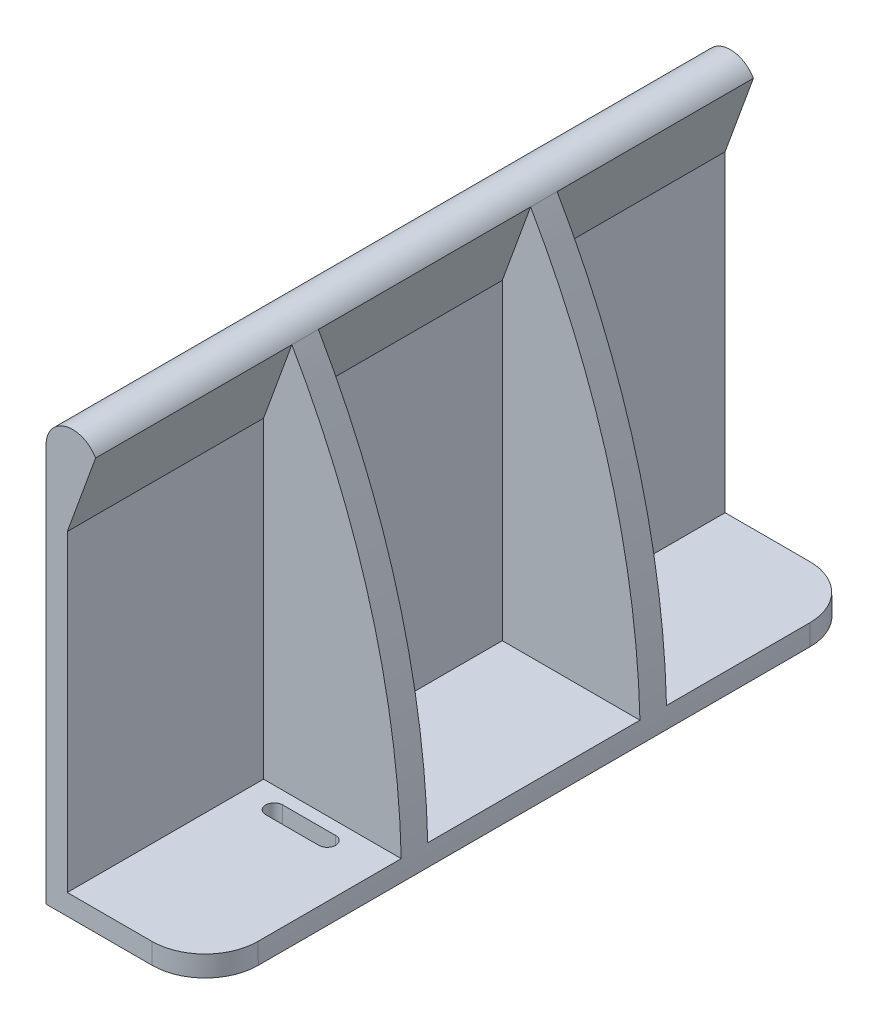
ISO-10303-21;
HEADER;
FILE_DESCRIPTION(('STEP AP214'),'2;1');
FILE_NAME('part.step','',(''),(''),'','','');
FILE_SCHEMA(('AUTOMOTIVE_DESIGN { 1 0 10303 214 1 1 1 1 }'));
ENDSEC;
DATA;
#1=APPLICATION_CONTEXT('core data for automotive mechanical design processes');
#2=APPLICATION_PROTOCOL_DEFINITION('international standard','automotive_design',2000,#1);
#3=PRODUCT_CONTEXT('',#1,'mechanical');
#4=PRODUCT('Part','Part','',(#3));
#5=PRODUCT_RELATED_PRODUCT_CATEGORY('part','',(#4));
#6=PRODUCT_DEFINITION_FORMATION('','',#4);
#7=PRODUCT_DEFINITION_CONTEXT('part definition',#1,'design');
#8=PRODUCT_DEFINITION('design','',#6,#7);
#9=PRODUCT_DEFINITION_SHAPE('','',#8);
#10=(LENGTH_UNIT() NAMED_UNIT(*) SI_UNIT(.MILLI.,.METRE.));
#11=(NAMED_UNIT(*) PLANE_ANGLE_UNIT() SI_UNIT($,.RADIAN.));
#12=(NAMED_UNIT(*) SI_UNIT($,.STERADIAN.) SOLID_ANGLE_UNIT());
#13=UNCERTAINTY_MEASURE_WITH_UNIT(LENGTH_MEASURE(1.E-05),#10,'distance_accuracy_value','');
#14=(GEOMETRIC_REPRESENTATION_CONTEXT(3) GLOBAL_UNCERTAINTY_ASSIGNED_CONTEXT((#13)) GLOBAL_UNIT_ASSIGNED_CONTEXT((#10,
#11,#12)) REPRESENTATION_CONTEXT('',''));
#15=CARTESIAN_POINT('',(0.,0.,0.));
#16=DIRECTION('',(0.,0.,1.));
#17=DIRECTION('',(1.,0.,0.));
#18=AXIS2_PLACEMENT_3D('',#15,#16,#17);
#19=CARTESIAN_POINT('',(-125.625,0.,62.));
#20=DIRECTION('',(0.,0.,-1.));
#21=DIRECTION('',(-1.,0.,0.));
#22=AXIS2_PLACEMENT_3D('',#19,#20,#21);
#23=CYLINDRICAL_SURFACE('',#22,155.625);
#24=DIRECTION('',(0.,0.,-1.));
#25=VECTOR('',#24,1.);
#26=CARTESIAN_POINT('',(30.,0.,62.));
#27=LINE('',#26,#25);
#28=CARTESIAN_POINT('',(30.,0.,52.));
#29=VERTEX_POINT('',#28);
#30=CARTESIAN_POINT('',(30.,0.,-52.));
#31=VERTEX_POINT('',#30);
#32=EDGE_CURVE('E373',#29,#31,#27,.T.);
#33=ORIENTED_EDGE('',*,*,#32,.T.);
#34=CARTESIAN_POINT('',(-125.625,0.,-52.));
#35=DIRECTION('',(0.,0.,-1.));
#36=DIRECTION('',(-1.,0.,0.));
#37=AXIS2_PLACEMENT_3D('',#34,#35,#36);
#38=CIRCLE('',#37,155.625);
#39=CARTESIAN_POINT('',(29.9510902997068,3.90137822537895,-52.));
#40=VERTEX_POINT('',#39);
#41=EDGE_CURVE('E394',#31,#40,#38,.F.);
#42=ORIENTED_EDGE('',*,*,#41,.T.);
#43=DIRECTION('',(0.,0.,-1.));
#44=VECTOR('',#43,1.);
#45=CARTESIAN_POINT('',(29.9510902997068,3.90137822537895,62.));
#46=LINE('',#45,#44);
#47=CARTESIAN_POINT('',(29.9510902997068,3.90137822537895,-25.));
#48=VERTEX_POINT('',#47);
#49=EDGE_CURVE('E294',#40,#48,#46,.F.);
#50=ORIENTED_EDGE('',*,*,#49,.T.);
#51=CARTESIAN_POINT('',(-125.625,0.,-25.));
#52=DIRECTION('',(0.,0.,-1.));
#53=DIRECTION('',(-1.,0.,0.));
#54=AXIS2_PLACEMENT_3D('',#51,#52,#53);
#55=CIRCLE('',#54,155.625);
#56=CARTESIAN_POINT('',(9.33609958506221,77.4896265560166,-25.));
#57=VERTEX_POINT('',#56);
#58=EDGE_CURVE('E296',#57,#48,#55,.T.);
#59=ORIENTED_EDGE('',*,*,#58,.F.);
#60=DIRECTION('',(0.,0.,-1.));
#61=VECTOR('',#60,1.);
#62=CARTESIAN_POINT('',(9.33609958506221,77.4896265560166,62.));
#63=LINE('',#62,#61);
#64=CARTESIAN_POINT('',(9.33609958506221,77.4896265560166,-20.));
#65=VERTEX_POINT('',#64);
#66=EDGE_CURVE('E369',#65,#57,#63,.T.);
#67=ORIENTED_EDGE('',*,*,#66,.F.);
#68=CARTESIAN_POINT('',(-125.625,0.,-20.));
#69=DIRECTION('',(0.,0.,1.));
#70=DIRECTION('',(1.,0.,0.));
#71=AXIS2_PLACEMENT_3D('',#68,#69,#70);
#72=CIRCLE('',#71,155.625);
#73=CARTESIAN_POINT('',(29.9485858846224,4.,-20.));
#74=VERTEX_POINT('',#73);
#75=EDGE_CURVE('E347',#74,#65,#72,.T.);
#76=ORIENTED_EDGE('',*,*,#75,.F.);
#77=DIRECTION('',(0.,0.,1.));
#78=VECTOR('',#77,1.);
#79=CARTESIAN_POINT('',(29.9485858846224,4.,-20.));
#80=LINE('',#79,#78);
#81=CARTESIAN_POINT('',(29.9485858846224,4.,20.));
#82=VERTEX_POINT('',#81);
#83=EDGE_CURVE('E335',#74,#82,#80,.T.);
#84=ORIENTED_EDGE('',*,*,#83,.T.);
#85=CARTESIAN_POINT('',(-125.625,0.,20.));
#86=DIRECTION('',(0.,0.,1.));
#87=DIRECTION('',(1.,0.,0.));
#88=AXIS2_PLACEMENT_3D('',#85,#86,#87);
#89=CIRCLE('',#88,155.625);
#90=CARTESIAN_POINT('',(9.33609958506221,77.4896265560166,20.));
#91=VERTEX_POINT('',#90);
#92=EDGE_CURVE('E338',#82,#91,#89,.T.);
#93=ORIENTED_EDGE('',*,*,#92,.T.);
#94=CARTESIAN_POINT('',(9.33609958506221,77.4896265560166,25.));
#95=VERTEX_POINT('',#94);
#96=EDGE_CURVE('E374',#95,#91,#63,.T.);
#97=ORIENTED_EDGE('',*,*,#96,.F.);
#98=CARTESIAN_POINT('',(-125.625,0.,25.));
#99=DIRECTION('',(0.,0.,1.));
#100=DIRECTION('',(1.,0.,0.));
#101=AXIS2_PLACEMENT_3D('',#98,#99,#100);
#102=CIRCLE('',#101,155.625);
#103=CARTESIAN_POINT('',(29.9510902997068,3.90137822537895,25.));
#104=VERTEX_POINT('',#103);
#105=EDGE_CURVE('E314',#104,#95,#102,.T.);
#106=ORIENTED_EDGE('',*,*,#105,.F.);
#107=DIRECTION('',(0.,0.,-1.));
#108=VECTOR('',#107,1.);
#109=CARTESIAN_POINT('',(29.9510902997068,3.90137822537895,62.));
#110=LINE('',#109,#108);
#111=CARTESIAN_POINT('',(29.9510902997068,3.90137822537895,52.));
#112=VERTEX_POINT('',#111);
#113=EDGE_CURVE('E312',#112,#104,#110,.T.);
#114=ORIENTED_EDGE('',*,*,#113,.F.);
#115=CARTESIAN_POINT('',(-125.625,0.,52.));
#116=DIRECTION('',(0.,0.,-1.));
#117=DIRECTION('',(-1.,0.,0.));
#118=AXIS2_PLACEMENT_3D('',#115,#116,#117);
#119=CIRCLE('',#118,155.625);
#120=EDGE_CURVE('E392',#112,#29,#119,.T.);
#121=ORIENTED_EDGE('',*,*,#120,.T.);
#122=EDGE_LOOP('',(#33,#42,#50,#59,#67,#76,#84,#93,#97,#106,#114,#121));
#123=FACE_BOUND('',#122,.T.);
#124=ADVANCED_FACE('F33',(#123),#23,.T.);
#125=CARTESIAN_POINT('',(5.,75.,62.));
#126=DIRECTION('',(0.,0.,-1.));
#127=DIRECTION('',(-1.,0.,0.));
#128=AXIS2_PLACEMENT_3D('',#125,#126,#127);
#129=PLANE('',#128);
#130=DIRECTION('',(1.,0.,0.));
#131=VECTOR('',#130,1.);
#132=CARTESIAN_POINT('',(30.,0.,62.));
#133=LINE('',#132,#131);
#134=CARTESIAN_POINT('',(0.,0.,62.));
#135=VERTEX_POINT('',#134);
#136=CARTESIAN_POINT('',(20.,0.,62.));
#137=VERTEX_POINT('',#136);
#138=EDGE_CURVE('E351',#135,#137,#133,.T.);
#139=ORIENTED_EDGE('',*,*,#138,.T.);
#140=CARTESIAN_POINT('',(-125.625,0.,62.));
#141=DIRECTION('',(0.,0.,-1.));
#142=DIRECTION('',(-1.,0.,0.));
#143=AXIS2_PLACEMENT_3D('',#140,#141,#142);
#144=CIRCLE('',#143,145.625);
#145=CARTESIAN_POINT('',(19.9477305265053,3.90137822537895,62.));
#146=VERTEX_POINT('',#145);
#147=EDGE_CURVE('E47',#137,#146,#144,.F.);
#148=ORIENTED_EDGE('',*,*,#147,.T.);
#149=DIRECTION('',(1.,0.,0.));
#150=VECTOR('',#149,1.);
#151=CARTESIAN_POINT('',(5.,3.90137822537895,62.));
#152=LINE('',#151,#150);
#153=CARTESIAN_POINT('',(4.,3.90137822537895,62.));
#154=VERTEX_POINT('',#153);
#155=EDGE_CURVE('E377',#154,#146,#152,.T.);
#156=ORIENTED_EDGE('',*,*,#155,.F.);
#157=DIRECTION('',(0.,-1.,0.));
#158=VECTOR('',#157,1.);
#159=CARTESIAN_POINT('',(4.,75.,62.));
#160=LINE('',#159,#158);
#161=CARTESIAN_POINT('',(4.,62.828813438097,62.));
#162=VERTEX_POINT('',#161);
#163=EDGE_CURVE('E380',#162,#154,#160,.T.);
#164=ORIENTED_EDGE('',*,*,#163,.F.);
#165=DIRECTION('',(-0.34202014332567,-0.939692620785908,0.));
#166=VECTOR('',#165,1.);
#167=CARTESIAN_POINT('',(8.02872173702779,73.8976354398468,62.));
#168=LINE('',#167,#166);
#169=CARTESIAN_POINT('',(9.33609958506221,77.4896265560166,62.));
#170=VERTEX_POINT('',#169);
#171=EDGE_CURVE('E383',#170,#162,#168,.T.);
#172=ORIENTED_EDGE('',*,*,#171,.F.);
#173=CARTESIAN_POINT('',(5.,75.,62.));
#174=DIRECTION('',(0.,0.,1.));
#175=DIRECTION('',(-1.,0.,0.));
#176=AXIS2_PLACEMENT_3D('',#173,#174,#175);
#177=CIRCLE('',#176,4.99999999999996);
#178=CARTESIAN_POINT('',(0.,75.,62.));
#179=VERTEX_POINT('',#178);
#180=EDGE_CURVE('E353',#170,#179,#177,.T.);
#181=ORIENTED_EDGE('',*,*,#180,.T.);
#182=DIRECTION('',(0.,-1.,0.));
#183=VECTOR('',#182,1.);
#184=CARTESIAN_POINT('',(0.,0.,62.));
#185=LINE('',#184,#183);
#186=EDGE_CURVE('E356',#179,#135,#185,.T.);
#187=ORIENTED_EDGE('',*,*,#186,.T.);
#188=EDGE_LOOP('',(#139,#148,#156,#164,#172,#181,#187));
#189=FACE_BOUND('',#188,.T.);
#190=ADVANCED_FACE('F453',(#189),#129,.F.);
#191=CARTESIAN_POINT('',(30.,0.,62.));
#192=DIRECTION('',(0.,1.,0.));
#193=DIRECTION('',(-1.,0.,0.));
#194=AXIS2_PLACEMENT_3D('',#191,#192,#193);
#195=PLANE('',#194);
#196=CARTESIAN_POINT('',(20.,0.,29.));
#197=DIRECTION('',(0.,-1.,0.));
#198=DIRECTION('',(1.,0.,0.));
#199=AXIS2_PLACEMENT_3D('',#196,#197,#198);
#200=CIRCLE('',#199,1.6);
#201=CARTESIAN_POINT('',(20.,0.,27.4));
#202=VERTEX_POINT('',#201);
#203=CARTESIAN_POINT('',(20.,0.,30.6));
#204=VERTEX_POINT('',#203);
#205=EDGE_CURVE('E232',#202,#204,#200,.T.);
#206=ORIENTED_EDGE('',*,*,#205,.F.);
#207=DIRECTION('',(1.,0.,0.));
#208=VECTOR('',#207,1.);
#209=CARTESIAN_POINT('',(10.,0.,27.4));
#210=LINE('',#209,#208);
#211=CARTESIAN_POINT('',(10.,0.,27.4));
#212=VERTEX_POINT('',#211);
#213=EDGE_CURVE('E224',#212,#202,#210,.T.);
#214=ORIENTED_EDGE('',*,*,#213,.F.);
#215=CARTESIAN_POINT('',(10.,0.,29.));
#216=DIRECTION('',(0.,-1.,0.));
#217=DIRECTION('',(1.,0.,0.));
#218=AXIS2_PLACEMENT_3D('',#215,#216,#217);
#219=CIRCLE('',#218,1.6);
#220=CARTESIAN_POINT('',(10.,0.,30.6));
#221=VERTEX_POINT('',#220);
#222=EDGE_CURVE('E236',#221,#212,#219,.T.);
#223=ORIENTED_EDGE('',*,*,#222,.F.);
#224=DIRECTION('',(-1.,0.,0.));
#225=VECTOR('',#224,1.);
#226=CARTESIAN_POINT('',(10.,0.,30.6));
#227=LINE('',#226,#225);
#228=EDGE_CURVE('E230',#204,#221,#227,.T.);
#229=ORIENTED_EDGE('',*,*,#228,.F.);
#230=EDGE_LOOP('',(#206,#214,#223,#229));
#231=FACE_BOUND('',#230,.T.);
#232=CARTESIAN_POINT('',(20.,0.,-29.));
#233=DIRECTION('',(0.,-1.,0.));
#234=DIRECTION('',(-1.,0.,0.));
#235=AXIS2_PLACEMENT_3D('',#232,#233,#234);
#236=CIRCLE('',#235,1.6);
#237=CARTESIAN_POINT('',(20.,0.,-30.6));
#238=VERTEX_POINT('',#237);
#239=CARTESIAN_POINT('',(20.,0.,-27.4));
#240=VERTEX_POINT('',#239);
#241=EDGE_CURVE('E251',#238,#240,#236,.T.);
#242=ORIENTED_EDGE('',*,*,#241,.F.);
#243=DIRECTION('',(1.,0.,0.));
#244=VECTOR('',#243,1.);
#245=CARTESIAN_POINT('',(10.,0.,-30.6));
#246=LINE('',#245,#244);
#247=CARTESIAN_POINT('',(10.,0.,-30.6));
#248=VERTEX_POINT('',#247);
#249=EDGE_CURVE('E254',#248,#238,#246,.T.);
#250=ORIENTED_EDGE('',*,*,#249,.F.);
#251=CARTESIAN_POINT('',(10.,0.,-29.));
#252=DIRECTION('',(0.,-1.,0.));
#253=DIRECTION('',(-1.,0.,0.));
#254=AXIS2_PLACEMENT_3D('',#251,#252,#253);
#255=CIRCLE('',#254,1.6);
#256=CARTESIAN_POINT('',(10.,0.,-27.4));
#257=VERTEX_POINT('',#256);
#258=EDGE_CURVE('E257',#257,#248,#255,.T.);
#259=ORIENTED_EDGE('',*,*,#258,.F.);
#260=DIRECTION('',(-1.,0.,0.));
#261=VECTOR('',#260,1.);
#262=CARTESIAN_POINT('',(10.,0.,-27.4));
#263=LINE('',#262,#261);
#264=EDGE_CURVE('E248',#240,#257,#263,.T.);
#265=ORIENTED_EDGE('',*,*,#264,.F.);
#266=EDGE_LOOP('',(#242,#250,#259,#265));
#267=FACE_BOUND('',#266,.T.);
#268=DIRECTION('',(1.,0.,0.));
#269=VECTOR('',#268,1.);
#270=CARTESIAN_POINT('',(30.,0.,-62.));
#271=LINE('',#270,#269);
#272=CARTESIAN_POINT('',(0.,0.,-62.));
#273=VERTEX_POINT('',#272);
#274=CARTESIAN_POINT('',(20.,0.,-62.));
#275=VERTEX_POINT('',#274);
#276=EDGE_CURVE('E350',#273,#275,#271,.T.);
#277=ORIENTED_EDGE('',*,*,#276,.T.);
#278=CARTESIAN_POINT('',(20.,0.,-52.));
#279=DIRECTION('',(0.,1.,0.));
#280=DIRECTION('',(-1.,0.,0.));
#281=AXIS2_PLACEMENT_3D('',#278,#279,#280);
#282=CIRCLE('',#281,10.);
#283=EDGE_CURVE('E482',#275,#31,#282,.F.);
#284=ORIENTED_EDGE('',*,*,#283,.T.);
#285=ORIENTED_EDGE('',*,*,#32,.F.);
#286=CARTESIAN_POINT('',(20.,0.,52.));
#287=DIRECTION('',(0.,1.,0.));
#288=DIRECTION('',(-1.,0.,0.));
#289=AXIS2_PLACEMENT_3D('',#286,#287,#288);
#290=CIRCLE('',#289,10.);
#291=EDGE_CURVE('E60',#29,#137,#290,.F.);
#292=ORIENTED_EDGE('',*,*,#291,.T.);
#293=ORIENTED_EDGE('',*,*,#138,.F.);
#294=DIRECTION('',(0.,0.,-1.));
#295=VECTOR('',#294,1.);
#296=CARTESIAN_POINT('',(0.,0.,62.));
#297=LINE('',#296,#295);
#298=EDGE_CURVE('E358',#135,#273,#297,.T.);
#299=ORIENTED_EDGE('',*,*,#298,.T.);
#300=EDGE_LOOP('',(#277,#284,#285,#292,#293,#299));
#301=FACE_BOUND('',#300,.T.);
#302=ADVANCED_FACE('F456',(#231,#267,#301),#195,.F.);
#303=CARTESIAN_POINT('',(5.,75.,62.));
#304=DIRECTION('',(0.,0.,-1.));
#305=DIRECTION('',(-1.,0.,0.));
#306=AXIS2_PLACEMENT_3D('',#303,#304,#305);
#307=CYLINDRICAL_SURFACE('',#306,4.99999999999996);
#308=CARTESIAN_POINT('',(5.,75.,-62.));
#309=DIRECTION('',(0.,0.,1.));
#310=DIRECTION('',(-1.,0.,0.));
#311=AXIS2_PLACEMENT_3D('',#308,#309,#310);
#312=CIRCLE('',#311,4.99999999999996);
#313=CARTESIAN_POINT('',(9.33609958506221,77.4896265560166,-62.));
#314=VERTEX_POINT('',#313);
#315=CARTESIAN_POINT('',(0.,75.,-62.));
#316=VERTEX_POINT('',#315);
#317=EDGE_CURVE('E361',#314,#316,#312,.T.);
#318=ORIENTED_EDGE('',*,*,#317,.T.);
#319=DIRECTION('',(0.,0.,-1.));
#320=VECTOR('',#319,1.);
#321=CARTESIAN_POINT('',(0.,75.,62.));
#322=LINE('',#321,#320);
#323=EDGE_CURVE('E366',#179,#316,#322,.T.);
#324=ORIENTED_EDGE('',*,*,#323,.F.);
#325=ORIENTED_EDGE('',*,*,#180,.F.);
#326=EDGE_CURVE('E370',#170,#95,#63,.T.);
#327=ORIENTED_EDGE('',*,*,#326,.T.);
#328=ORIENTED_EDGE('',*,*,#96,.T.);
#329=DIRECTION('',(0.,0.,1.));
#330=VECTOR('',#329,1.);
#331=CARTESIAN_POINT('',(9.33609958506221,77.4896265560166,-20.));
#332=LINE('',#331,#330);
#333=EDGE_CURVE('E327',#65,#91,#332,.T.);
#334=ORIENTED_EDGE('',*,*,#333,.F.);
#335=ORIENTED_EDGE('',*,*,#66,.T.);
#336=DIRECTION('',(0.,0.,1.));
#337=VECTOR('',#336,1.);
#338=CARTESIAN_POINT('',(9.33609958506221,77.4896265560166,-149.));
#339=LINE('',#338,#337);
#340=EDGE_CURVE('E288',#314,#57,#339,.T.);
#341=ORIENTED_EDGE('',*,*,#340,.F.);
#342=EDGE_LOOP('',(#318,#324,#325,#327,#328,#334,#335,#341));
#343=FACE_BOUND('',#342,.T.);
#344=ADVANCED_FACE('F464',(#343),#307,.T.);
#345=CARTESIAN_POINT('',(0.,0.,62.));
#346=DIRECTION('',(1.,0.,0.));
#347=DIRECTION('',(0.,0.,-1.));
#348=AXIS2_PLACEMENT_3D('',#345,#346,#347);
#349=PLANE('',#348);
#350=DIRECTION('',(0.,-1.,0.));
#351=VECTOR('',#350,1.);
#352=CARTESIAN_POINT('',(0.,0.,-62.));
#353=LINE('',#352,#351);
#354=EDGE_CURVE('E354',#316,#273,#353,.T.);
#355=ORIENTED_EDGE('',*,*,#354,.T.);
#356=ORIENTED_EDGE('',*,*,#298,.F.);
#357=ORIENTED_EDGE('',*,*,#186,.F.);
#358=ORIENTED_EDGE('',*,*,#323,.T.);
#359=EDGE_LOOP('',(#355,#356,#357,#358));
#360=FACE_BOUND('',#359,.T.);
#361=ADVANCED_FACE('F460',(#360),#349,.F.);
#362=CARTESIAN_POINT('',(5.,75.,-62.));
#363=DIRECTION('',(0.,0.,-1.));
#364=DIRECTION('',(-1.,0.,0.));
#365=AXIS2_PLACEMENT_3D('',#362,#363,#364);
#366=PLANE('',#365);
#367=DIRECTION('',(-1.,0.,0.));
#368=VECTOR('',#367,1.);
#369=CARTESIAN_POINT('',(5.,3.90137822537895,-62.));
#370=LINE('',#369,#368);
#371=CARTESIAN_POINT('',(19.9477305265053,3.90137822537895,-62.));
#372=VERTEX_POINT('',#371);
#373=CARTESIAN_POINT('',(4.,3.90137822537895,-62.));
#374=VERTEX_POINT('',#373);
#375=EDGE_CURVE('E390',#372,#374,#370,.T.);
#376=ORIENTED_EDGE('',*,*,#375,.F.);
#377=CARTESIAN_POINT('',(-125.625,0.,-62.));
#378=DIRECTION('',(0.,0.,-1.));
#379=DIRECTION('',(-1.,0.,0.));
#380=AXIS2_PLACEMENT_3D('',#377,#378,#379);
#381=CIRCLE('',#380,145.625);
#382=EDGE_CURVE('E404',#372,#275,#381,.T.);
#383=ORIENTED_EDGE('',*,*,#382,.T.);
#384=ORIENTED_EDGE('',*,*,#276,.F.);
#385=ORIENTED_EDGE('',*,*,#354,.F.);
#386=ORIENTED_EDGE('',*,*,#317,.F.);
#387=DIRECTION('',(0.34202014332567,0.939692620785908,0.));
#388=VECTOR('',#387,1.);
#389=CARTESIAN_POINT('',(8.02872173702779,73.8976354398468,-62.));
#390=LINE('',#389,#388);
#391=CARTESIAN_POINT('',(4.,62.828813438097,-62.));
#392=VERTEX_POINT('',#391);
#393=EDGE_CURVE('E385',#392,#314,#390,.T.);
#394=ORIENTED_EDGE('',*,*,#393,.F.);
#395=DIRECTION('',(0.,1.,0.));
#396=VECTOR('',#395,1.);
#397=CARTESIAN_POINT('',(4.,75.,-62.));
#398=LINE('',#397,#396);
#399=EDGE_CURVE('E387',#374,#392,#398,.T.);
#400=ORIENTED_EDGE('',*,*,#399,.F.);
#401=EDGE_LOOP('',(#376,#383,#384,#385,#386,#394,#400));
#402=FACE_BOUND('',#401,.T.);
#403=ADVANCED_FACE('F437',(#402),#366,.T.);
#404=CARTESIAN_POINT('',(0.,0.,-20.));
#405=DIRECTION('',(0.,0.,1.));
#406=DIRECTION('',(1.,0.,0.));
#407=AXIS2_PLACEMENT_3D('',#404,#405,#406);
#408=PLANE('',#407);
#409=ORIENTED_EDGE('',*,*,#75,.T.);
#410=DIRECTION('',(-0.34202014332567,-0.939692620785908,0.));
#411=VECTOR('',#410,1.);
#412=CARTESIAN_POINT('',(9.33609958506221,77.4896265560166,-20.));
#413=LINE('',#412,#411);
#414=CARTESIAN_POINT('',(4.,62.828813438097,-20.));
#415=VERTEX_POINT('',#414);
#416=EDGE_CURVE('E317',#65,#415,#413,.T.);
#417=ORIENTED_EDGE('',*,*,#416,.T.);
#418=DIRECTION('',(0.,-1.,0.));
#419=VECTOR('',#418,1.);
#420=CARTESIAN_POINT('',(4.,62.828813438097,-20.));
#421=LINE('',#420,#419);
#422=CARTESIAN_POINT('',(4.00000000000001,4.,-20.));
#423=VERTEX_POINT('',#422);
#424=EDGE_CURVE('E320',#415,#423,#421,.T.);
#425=ORIENTED_EDGE('',*,*,#424,.T.);
#426=DIRECTION('',(1.,0.,0.));
#427=VECTOR('',#426,1.);
#428=CARTESIAN_POINT('',(4.00000000000001,4.,-20.));
#429=LINE('',#428,#427);
#430=EDGE_CURVE('E324',#423,#74,#429,.T.);
#431=ORIENTED_EDGE('',*,*,#430,.T.);
#432=EDGE_LOOP('',(#409,#417,#425,#431));
#433=FACE_BOUND('',#432,.T.);
#434=ADVANCED_FACE('F433',(#433),#408,.T.);
#435=CARTESIAN_POINT('',(0.,0.,20.));
#436=DIRECTION('',(0.,0.,1.));
#437=DIRECTION('',(1.,0.,0.));
#438=AXIS2_PLACEMENT_3D('',#435,#436,#437);
#439=PLANE('',#438);
#440=DIRECTION('',(1.,0.,0.));
#441=VECTOR('',#440,1.);
#442=CARTESIAN_POINT('',(4.00000000000001,4.,20.));
#443=LINE('',#442,#441);
#444=CARTESIAN_POINT('',(4.00000000000001,4.,20.));
#445=VERTEX_POINT('',#444);
#446=EDGE_CURVE('E321',#445,#82,#443,.T.);
#447=ORIENTED_EDGE('',*,*,#446,.F.);
#448=DIRECTION('',(0.,-1.,0.));
#449=VECTOR('',#448,1.);
#450=CARTESIAN_POINT('',(4.,62.828813438097,20.));
#451=LINE('',#450,#449);
#452=CARTESIAN_POINT('',(4.,62.828813438097,20.));
#453=VERTEX_POINT('',#452);
#454=EDGE_CURVE('E330',#453,#445,#451,.T.);
#455=ORIENTED_EDGE('',*,*,#454,.F.);
#456=DIRECTION('',(-0.34202014332567,-0.939692620785908,0.));
#457=VECTOR('',#456,1.);
#458=CARTESIAN_POINT('',(9.33609958506221,77.4896265560166,20.));
#459=LINE('',#458,#457);
#460=EDGE_CURVE('E316',#91,#453,#459,.T.);
#461=ORIENTED_EDGE('',*,*,#460,.F.);
#462=ORIENTED_EDGE('',*,*,#92,.F.);
#463=EDGE_LOOP('',(#447,#455,#461,#462));
#464=FACE_BOUND('',#463,.T.);
#465=ADVANCED_FACE('F436',(#464),#439,.F.);
#466=CARTESIAN_POINT('',(4.00000000000001,4.,-20.));
#467=DIRECTION('',(0.,-1.,0.));
#468=DIRECTION('',(0.,0.,-1.));
#469=AXIS2_PLACEMENT_3D('',#466,#467,#468);
#470=PLANE('',#469);
#471=ORIENTED_EDGE('',*,*,#446,.T.);
#472=ORIENTED_EDGE('',*,*,#83,.F.);
#473=ORIENTED_EDGE('',*,*,#430,.F.);
#474=DIRECTION('',(0.,0.,1.));
#475=VECTOR('',#474,1.);
#476=CARTESIAN_POINT('',(4.00000000000001,4.,-20.));
#477=LINE('',#476,#475);
#478=EDGE_CURVE('E339',#423,#445,#477,.T.);
#479=ORIENTED_EDGE('',*,*,#478,.T.);
#480=EDGE_LOOP('',(#471,#472,#473,#479));
#481=FACE_BOUND('',#480,.T.);
#482=ADVANCED_FACE('F441',(#481),#470,.F.);
#483=CARTESIAN_POINT('',(4.,62.828813438097,-20.));
#484=DIRECTION('',(-1.,0.,0.));
#485=DIRECTION('',(0.,-1.,0.));
#486=AXIS2_PLACEMENT_3D('',#483,#484,#485);
#487=PLANE('',#486);
#488=ORIENTED_EDGE('',*,*,#454,.T.);
#489=ORIENTED_EDGE('',*,*,#478,.F.);
#490=ORIENTED_EDGE('',*,*,#424,.F.);
#491=DIRECTION('',(0.,0.,1.));
#492=VECTOR('',#491,1.);
#493=CARTESIAN_POINT('',(4.,62.828813438097,-20.));
#494=LINE('',#493,#492);
#495=EDGE_CURVE('E341',#415,#453,#494,.T.);
#496=ORIENTED_EDGE('',*,*,#495,.T.);
#497=EDGE_LOOP('',(#488,#489,#490,#496));
#498=FACE_BOUND('',#497,.T.);
#499=ADVANCED_FACE('F445',(#498),#487,.F.);
#500=CARTESIAN_POINT('',(9.33609958506221,77.4896265560166,-20.));
#501=DIRECTION('',(-0.939692620785908,0.34202014332567,0.));
#502=DIRECTION('',(-0.34202014332567,-0.939692620785908,0.));
#503=AXIS2_PLACEMENT_3D('',#500,#501,#502);
#504=PLANE('',#503);
#505=ORIENTED_EDGE('',*,*,#460,.T.);
#506=ORIENTED_EDGE('',*,*,#495,.F.);
#507=ORIENTED_EDGE('',*,*,#416,.F.);
#508=ORIENTED_EDGE('',*,*,#333,.T.);
#509=EDGE_LOOP('',(#505,#506,#507,#508));
#510=FACE_BOUND('',#509,.T.);
#511=ADVANCED_FACE('F421',(#510),#504,.F.);
#512=CARTESIAN_POINT('',(0.,0.,25.));
#513=DIRECTION('',(0.,0.,1.));
#514=DIRECTION('',(1.,0.,0.));
#515=AXIS2_PLACEMENT_3D('',#512,#513,#514);
#516=PLANE('',#515);
#517=ORIENTED_EDGE('',*,*,#105,.T.);
#518=DIRECTION('',(-0.34202014332567,-0.939692620785908,0.));
#519=VECTOR('',#518,1.);
#520=CARTESIAN_POINT('',(9.33609958506221,77.4896265560166,25.));
#521=LINE('',#520,#519);
#522=CARTESIAN_POINT('',(4.,62.828813438097,25.));
#523=VERTEX_POINT('',#522);
#524=EDGE_CURVE('E299',#95,#523,#521,.T.);
#525=ORIENTED_EDGE('',*,*,#524,.T.);
#526=DIRECTION('',(0.,-1.,0.));
#527=VECTOR('',#526,1.);
#528=CARTESIAN_POINT('',(4.,62.828813438097,25.));
#529=LINE('',#528,#527);
#530=CARTESIAN_POINT('',(4.,3.90137822537895,25.));
#531=VERTEX_POINT('',#530);
#532=EDGE_CURVE('E302',#523,#531,#529,.T.);
#533=ORIENTED_EDGE('',*,*,#532,.T.);
#534=DIRECTION('',(1.,0.,0.));
#535=VECTOR('',#534,1.);
#536=CARTESIAN_POINT('',(4.,3.90137822537895,25.));
#537=LINE('',#536,#535);
#538=EDGE_CURVE('E305',#531,#104,#537,.T.);
#539=ORIENTED_EDGE('',*,*,#538,.T.);
#540=EDGE_LOOP('',(#517,#525,#533,#539));
#541=FACE_BOUND('',#540,.T.);
#542=ADVANCED_FACE('F418',(#541),#516,.T.);
#543=CARTESIAN_POINT('',(9.33609958506221,77.4896265560166,149.));
#544=DIRECTION('',(0.939692620785908,-0.34202014332567,0.));
#545=DIRECTION('',(0.34202014332567,0.939692620785908,0.));
#546=AXIS2_PLACEMENT_3D('',#543,#544,#545);
#547=PLANE('',#546);
#548=ORIENTED_EDGE('',*,*,#171,.T.);
#549=DIRECTION('',(0.,0.,-1.));
#550=VECTOR('',#549,1.);
#551=CARTESIAN_POINT('',(4.,62.828813438097,149.));
#552=LINE('',#551,#550);
#553=EDGE_CURVE('E310',#162,#523,#552,.T.);
#554=ORIENTED_EDGE('',*,*,#553,.T.);
#555=ORIENTED_EDGE('',*,*,#524,.F.);
#556=ORIENTED_EDGE('',*,*,#326,.F.);
#557=EDGE_LOOP('',(#548,#554,#555,#556));
#558=FACE_BOUND('',#557,.T.);
#559=ADVANCED_FACE('F420',(#558),#547,.T.);
#560=CARTESIAN_POINT('',(4.,62.828813438097,149.));
#561=DIRECTION('',(1.,0.,0.));
#562=DIRECTION('',(0.,0.,-1.));
#563=AXIS2_PLACEMENT_3D('',#560,#561,#562);
#564=PLANE('',#563);
#565=ORIENTED_EDGE('',*,*,#163,.T.);
#566=DIRECTION('',(0.,0.,-1.));
#567=VECTOR('',#566,1.);
#568=CARTESIAN_POINT('',(4.,3.90137822537895,149.));
#569=LINE('',#568,#567);
#570=EDGE_CURVE('E308',#154,#531,#569,.T.);
#571=ORIENTED_EDGE('',*,*,#570,.T.);
#572=ORIENTED_EDGE('',*,*,#532,.F.);
#573=ORIENTED_EDGE('',*,*,#553,.F.);
#574=EDGE_LOOP('',(#565,#571,#572,#573));
#575=FACE_BOUND('',#574,.T.);
#576=ADVANCED_FACE('F426',(#575),#564,.T.);
#577=CARTESIAN_POINT('',(4.,3.90137822537895,149.));
#578=DIRECTION('',(0.,1.,0.));
#579=DIRECTION('',(0.,0.,1.));
#580=AXIS2_PLACEMENT_3D('',#577,#578,#579);
#581=PLANE('',#580);
#582=DIRECTION('',(1.,0.,0.));
#583=VECTOR('',#582,1.);
#584=CARTESIAN_POINT('',(10.,3.90137822537895,27.4));
#585=LINE('',#584,#583);
#586=CARTESIAN_POINT('',(10.,3.90137822537895,27.4));
#587=VERTEX_POINT('',#586);
#588=CARTESIAN_POINT('',(20.,3.90137822537895,27.4));
#589=VERTEX_POINT('',#588);
#590=EDGE_CURVE('E221',#587,#589,#585,.T.);
#591=ORIENTED_EDGE('',*,*,#590,.T.);
#592=CARTESIAN_POINT('',(20.,3.90137822537895,29.));
#593=DIRECTION('',(0.,1.,0.));
#594=DIRECTION('',(0.,0.,1.));
#595=AXIS2_PLACEMENT_3D('',#592,#593,#594);
#596=CIRCLE('',#595,1.6);
#597=CARTESIAN_POINT('',(20.,3.90137822537895,30.6));
#598=VERTEX_POINT('',#597);
#599=EDGE_CURVE('E207',#589,#598,#596,.F.);
#600=ORIENTED_EDGE('',*,*,#599,.T.);
#601=DIRECTION('',(-1.,0.,0.));
#602=VECTOR('',#601,1.);
#603=CARTESIAN_POINT('',(10.,3.90137822537895,30.6));
#604=LINE('',#603,#602);
#605=CARTESIAN_POINT('',(10.,3.90137822537895,30.6));
#606=VERTEX_POINT('',#605);
#607=EDGE_CURVE('E241',#598,#606,#604,.T.);
#608=ORIENTED_EDGE('',*,*,#607,.T.);
#609=CARTESIAN_POINT('',(10.,3.90137822537895,29.));
#610=DIRECTION('',(0.,1.,0.));
#611=DIRECTION('',(0.,0.,1.));
#612=AXIS2_PLACEMENT_3D('',#609,#610,#611);
#613=CIRCLE('',#612,1.6);
#614=EDGE_CURVE('E229',#606,#587,#613,.F.);
#615=ORIENTED_EDGE('',*,*,#614,.T.);
#616=EDGE_LOOP('',(#591,#600,#608,#615));
#617=FACE_BOUND('',#616,.T.);
#618=ORIENTED_EDGE('',*,*,#155,.T.);
#619=CARTESIAN_POINT('',(19.9477305265053,3.90137822537895,62.));
#620=CARTESIAN_POINT('',(20.2291569530737,3.90137822537895,62.0000301939684));
#621=CARTESIAN_POINT('',(20.510579097633,3.90137822537895,61.988129668099));
#622=CARTESIAN_POINT('',(21.0714105769643,3.90137822537895,61.9406849224709));
#623=CARTESIAN_POINT('',(21.3508200058334,3.90137822537895,61.905141815383));
#624=CARTESIAN_POINT('',(21.90544210072,3.90137822537895,61.8106648031245));
#625=CARTESIAN_POINT('',(22.1806577368235,3.90137822537895,61.7517483350012));
#626=CARTESIAN_POINT('',(22.7251472076753,3.90137822537895,61.6109520753077));
#627=CARTESIAN_POINT('',(22.9944211160741,3.90137822537895,61.5290725685474));
#628=CARTESIAN_POINT('',(23.5252450520576,3.90137822537895,61.3428828353212));
#629=CARTESIAN_POINT('',(23.7867912969768,3.90137822537895,61.2385618241212));
#630=CARTESIAN_POINT('',(24.3001692346777,3.90137822537895,61.0082510421527));
#631=CARTESIAN_POINT('',(24.5520007237475,3.90137822537895,60.8822608172977));
#632=CARTESIAN_POINT('',(25.0441052268283,3.90137822537895,60.6095330569549));
#633=CARTESIAN_POINT('',(25.2843803948974,3.90137822537895,60.4627994082132));
#634=CARTESIAN_POINT('',(25.7517117133634,3.90137822537895,60.1496097983255));
#635=CARTESIAN_POINT('',(25.9787679371425,3.90137822537895,59.9831539466786));
#636=CARTESIAN_POINT('',(26.418006742917,3.90137822537895,59.6317335761067));
#637=CARTESIAN_POINT('',(26.6301920211501,3.90137822537895,59.4467724272));
#638=CARTESIAN_POINT('',(27.0382240841612,3.90137822537895,59.0596300815848));
#639=CARTESIAN_POINT('',(27.2340708734718,3.90137822537895,58.8574488896534));
#640=CARTESIAN_POINT('',(27.608069839314,3.90137822537895,58.4372600981834));
#641=CARTESIAN_POINT('',(27.7862184032015,3.90137822537895,58.2192492830841));
#642=CARTESIAN_POINT('',(28.1235036889816,3.90137822537895,57.768991665187));
#643=CARTESIAN_POINT('',(28.2826407085321,3.90137822537895,57.5367450853605));
#644=CARTESIAN_POINT('',(28.5807560610538,3.90137822537895,57.0596896411773));
#645=CARTESIAN_POINT('',(28.7197365706559,3.90137822537895,56.8148821371017));
#646=CARTESIAN_POINT('',(28.9765664761886,3.90137822537895,56.3144309699506));
#647=CARTESIAN_POINT('',(29.0944162310417,3.90137822537895,56.0587874910238));
#648=CARTESIAN_POINT('',(29.3080990402425,3.90137822537895,55.5385866278344));
#649=CARTESIAN_POINT('',(29.4039422636961,3.90137822537895,55.2740334257779));
#650=CARTESIAN_POINT('',(29.5729748225715,3.90137822537895,54.7378964852024));
#651=CARTESIAN_POINT('',(29.6461696228596,3.90137822537895,54.4663144598423));
#652=CARTESIAN_POINT('',(29.7886103150593,3.90137822537895,53.8324520993274));
#653=CARTESIAN_POINT('',(29.8495382843014,3.90137822537895,53.4682486267426));
#654=CARTESIAN_POINT('',(29.9104623152977,3.90137822537895,52.9190266543489));
#655=CARTESIAN_POINT('',(29.9256923249709,3.90137822537895,52.7355599511998));
#656=CARTESIAN_POINT('',(29.9460051053533,3.90137822537895,52.3680771635255));
#657=CARTESIAN_POINT('',(29.9510885138484,3.90137822537895,52.1840611142588));
#658=CARTESIAN_POINT('',(29.9510902997068,3.90137822537895,52.));
#659=B_SPLINE_CURVE_WITH_KNOTS('',3,(#619,#620,#621,#622,#623,#624,#625,#626,#627,#628,#629,
#630,#631,#632,#633,#634,#635,#636,#637,#638,#639,#640,#641,#642,#643,#644,#645,#646,#647,#648,
#649,#650,#651,#652,#653,#654,#655,#656,#657,#658),.UNSPECIFIED.,.F.,.F.,(4,2,2,2,2,2,2,2,2,2,2,
2,2,2,2,2,2,2,2,4),(0.,0.844021745141287,1.68800377161572,2.53135734916943,3.37470046709693,
4.21844978021972,5.06221677657953,5.90582588328881,6.74943030644042,7.59288137861905,
8.43633221681637,9.27995487188188,10.1235643168735,10.9670825954992,11.8105865449433,
12.6536999275341,13.4966097153183,14.601840516311,15.1538984448913,15.7059216716218),.UNSPECIFIED.);
#660=EDGE_CURVE('E11',#146,#112,#659,.T.);
#661=ORIENTED_EDGE('',*,*,#660,.T.);
#662=ORIENTED_EDGE('',*,*,#113,.T.);
#663=ORIENTED_EDGE('',*,*,#538,.F.);
#664=ORIENTED_EDGE('',*,*,#570,.F.);
#665=EDGE_LOOP('',(#618,#661,#662,#663,#664));
#666=FACE_BOUND('',#665,.T.);
#667=ADVANCED_FACE('F227',(#617,#666),#581,.T.);
#668=CARTESIAN_POINT('',(0.,0.,-25.));
#669=DIRECTION('',(0.,0.,-1.));
#670=DIRECTION('',(1.,0.,0.));
#671=AXIS2_PLACEMENT_3D('',#668,#669,#670);
#672=PLANE('',#671);
#673=ORIENTED_EDGE('',*,*,#58,.T.);
#674=DIRECTION('',(1.,0.,0.));
#675=VECTOR('',#674,1.);
#676=CARTESIAN_POINT('',(4.,3.90137822537895,-25.));
#677=LINE('',#676,#675);
#678=CARTESIAN_POINT('',(4.,3.90137822537895,-25.));
#679=VERTEX_POINT('',#678);
#680=EDGE_CURVE('E247',#679,#48,#677,.T.);
#681=ORIENTED_EDGE('',*,*,#680,.F.);
#682=DIRECTION('',(0.,-1.,0.));
#683=VECTOR('',#682,1.);
#684=CARTESIAN_POINT('',(4.,62.828813438097,-25.));
#685=LINE('',#684,#683);
#686=CARTESIAN_POINT('',(4.,62.828813438097,-25.));
#687=VERTEX_POINT('',#686);
#688=EDGE_CURVE('E282',#687,#679,#685,.T.);
#689=ORIENTED_EDGE('',*,*,#688,.F.);
#690=DIRECTION('',(-0.34202014332567,-0.939692620785908,0.));
#691=VECTOR('',#690,1.);
#692=CARTESIAN_POINT('',(9.33609958506221,77.4896265560166,-25.));
#693=LINE('',#692,#691);
#694=EDGE_CURVE('E285',#57,#687,#693,.T.);
#695=ORIENTED_EDGE('',*,*,#694,.F.);
#696=EDGE_LOOP('',(#673,#681,#689,#695));
#697=FACE_BOUND('',#696,.T.);
#698=ADVANCED_FACE('F415',(#697),#672,.T.);
#699=CARTESIAN_POINT('',(4.,3.90137822537895,-149.));
#700=DIRECTION('',(0.,-1.,0.));
#701=DIRECTION('',(0.,0.,-1.));
#702=AXIS2_PLACEMENT_3D('',#699,#700,#701);
#703=PLANE('',#702);
#704=CARTESIAN_POINT('',(10.,3.90137822537895,-29.));
#705=DIRECTION('',(0.,1.,0.));
#706=DIRECTION('',(0.,0.,1.));
#707=AXIS2_PLACEMENT_3D('',#704,#705,#706);
#708=CIRCLE('',#707,1.6);
#709=CARTESIAN_POINT('',(10.,3.90137822537895,-27.4));
#710=VERTEX_POINT('',#709);
#711=CARTESIAN_POINT('',(10.,3.90137822537895,-30.6));
#712=VERTEX_POINT('',#711);
#713=EDGE_CURVE('E263',#710,#712,#708,.F.);
#714=ORIENTED_EDGE('',*,*,#713,.T.);
#715=DIRECTION('',(1.,0.,0.));
#716=VECTOR('',#715,1.);
#717=CARTESIAN_POINT('',(10.,3.90137822537895,-30.6));
#718=LINE('',#717,#716);
#719=CARTESIAN_POINT('',(20.,3.90137822537895,-30.6));
#720=VERTEX_POINT('',#719);
#721=EDGE_CURVE('E250',#712,#720,#718,.T.);
#722=ORIENTED_EDGE('',*,*,#721,.T.);
#723=CARTESIAN_POINT('',(20.,3.90137822537895,-29.));
#724=DIRECTION('',(0.,1.,0.));
#725=DIRECTION('',(0.,0.,1.));
#726=AXIS2_PLACEMENT_3D('',#723,#724,#725);
#727=CIRCLE('',#726,1.6);
#728=CARTESIAN_POINT('',(20.,3.90137822537895,-27.4));
#729=VERTEX_POINT('',#728);
#730=EDGE_CURVE('E272',#720,#729,#727,.F.);
#731=ORIENTED_EDGE('',*,*,#730,.T.);
#732=DIRECTION('',(-1.,0.,0.));
#733=VECTOR('',#732,1.);
#734=CARTESIAN_POINT('',(10.,3.90137822537895,-27.4));
#735=LINE('',#734,#733);
#736=EDGE_CURVE('E268',#729,#710,#735,.T.);
#737=ORIENTED_EDGE('',*,*,#736,.T.);
#738=EDGE_LOOP('',(#714,#722,#731,#737));
#739=FACE_BOUND('',#738,.T.);
#740=ORIENTED_EDGE('',*,*,#49,.F.);
#741=CARTESIAN_POINT('',(29.9510902997068,3.90137822537895,-52.));
#742=CARTESIAN_POINT('',(29.9511205951157,3.90137822537895,-52.2811950581208));
#743=CARTESIAN_POINT('',(29.9392272439069,3.90137822537895,-52.5623857421994));
#744=CARTESIAN_POINT('',(29.8918120797136,3.90137822537895,-53.1227547904193));
#745=CARTESIAN_POINT('',(29.8562914140952,3.90137822537895,-53.4019332516107));
#746=CARTESIAN_POINT('',(29.7618764886946,3.90137822537895,-53.9560902358881));
#747=CARTESIAN_POINT('',(29.7030001047211,3.90137822537895,-54.2310718043929));
#748=CARTESIAN_POINT('',(29.5623027945164,3.90137822537895,-54.7750971426583));
#749=CARTESIAN_POINT('',(29.4804821458106,3.90137822537895,-55.044140984197));
#750=CARTESIAN_POINT('',(29.2944315320359,3.90137822537895,-55.5745088110048));
#751=CARTESIAN_POINT('',(29.1901909726237,3.90137822537895,-55.8358290799316));
#752=CARTESIAN_POINT('',(28.9600639375849,3.90137822537895,-56.3487647010685));
#753=CARTESIAN_POINT('',(28.8341770007672,3.90137822537895,-56.6003798463644));
#754=CARTESIAN_POINT('',(28.5616796948029,3.90137822537895,-57.0920663517177));
#755=CARTESIAN_POINT('',(28.4150731073239,3.90137822537895,-57.332139807626));
#756=CARTESIAN_POINT('',(28.1021632424953,3.90137822537895,-57.7990857251788));
#757=CARTESIAN_POINT('',(27.9358600687789,3.90137822537895,-58.0259582562703));
#758=CARTESIAN_POINT('',(27.5847171286689,3.90137822537895,-58.4649207019712));
#759=CARTESIAN_POINT('',(27.3998750200072,3.90137822537895,-58.6770087429086));
#760=CARTESIAN_POINT('',(27.0129865374515,3.90137822537895,-59.0848650141414));
#761=CARTESIAN_POINT('',(26.810940158374,3.90137822537895,-59.2806332395196));
#762=CARTESIAN_POINT('',(26.3910370402475,3.90137822537895,-59.6544985655356));
#763=CARTESIAN_POINT('',(26.1731770916669,3.90137822537895,-59.8325920614385));
#764=CARTESIAN_POINT('',(25.7232362364551,3.90137822537895,-60.1697960520372));
#765=CARTESIAN_POINT('',(25.4911555449644,3.90137822537895,-60.3289068338082));
#766=CARTESIAN_POINT('',(25.0142970991139,3.90137822537895,-60.627096125199));
#767=CARTESIAN_POINT('',(24.7695129127049,3.90137822537895,-60.7661643495659));
#768=CARTESIAN_POINT('',(24.2691057838463,3.90137822537895,-61.023181996385));
#769=CARTESIAN_POINT('',(24.0134830179459,3.90137822537895,-61.1411317626713));
#770=CARTESIAN_POINT('',(23.4933179770687,3.90137822537895,-61.3550307020363));
#771=CARTESIAN_POINT('',(23.2287798125645,3.90137822537895,-61.4509898589941));
#772=CARTESIAN_POINT('',(22.6926675388278,3.90137822537895,-61.6202718651839));
#773=CARTESIAN_POINT('',(22.4210951313236,3.90137822537895,-61.6936001348661));
#774=CARTESIAN_POINT('',(21.7861084575758,3.90137822537895,-61.8366277994814));
#775=CARTESIAN_POINT('',(21.4207386807254,3.90137822537895,-61.8978905701898));
#776=CARTESIAN_POINT('',(20.8697437764329,3.90137822537895,-61.9591491467023));
#777=CARTESIAN_POINT('',(20.6856822428814,3.90137822537895,-61.9744627288872));
#778=CARTESIAN_POINT('',(20.3170057841321,3.90137822537895,-61.9948869102241));
#779=CARTESIAN_POINT('',(20.1323908953627,3.90137822537895,-61.9999981668535));
#780=CARTESIAN_POINT('',(19.9477305265053,3.90137822537895,-62.));
#781=B_SPLINE_CURVE_WITH_KNOTS('',3,(#741,#742,#743,#744,#745,#746,#747,#748,#749,#750,#751,
#752,#753,#754,#755,#756,#757,#758,#759,#760,#761,#762,#763,#764,#765,#766,#767,#768,#769,#770,
#771,#772,#773,#774,#775,#776,#777,#778,#779,#780),.UNSPECIFIED.,.F.,.F.,(4,2,2,2,2,2,2,2,2,2,2,
2,2,2,2,2,2,2,2,4),(0.,0.843327592595662,1.68661423534374,2.52925669170136,3.37188895620444,
4.21492027788996,5.05796956316759,5.90086517670125,6.7437563555526,7.5867541624354,
8.42975222331638,9.27292186060097,10.1160787450356,10.9596667838659,11.8032410868134,
12.6464316394492,13.489420077795,14.5982463254691,15.152101635176,15.7059212511483),.UNSPECIFIED.);
#782=EDGE_CURVE('E397',#40,#372,#781,.T.);
#783=ORIENTED_EDGE('',*,*,#782,.T.);
#784=ORIENTED_EDGE('',*,*,#375,.T.);
#785=DIRECTION('',(0.,0.,1.));
#786=VECTOR('',#785,1.);
#787=CARTESIAN_POINT('',(4.,3.90137822537895,-149.));
#788=LINE('',#787,#786);
#789=EDGE_CURVE('E292',#374,#679,#788,.T.);
#790=ORIENTED_EDGE('',*,*,#789,.T.);
#791=ORIENTED_EDGE('',*,*,#680,.T.);
#792=EDGE_LOOP('',(#740,#783,#784,#790,#791));
#793=FACE_BOUND('',#792,.T.);
#794=ADVANCED_FACE('F409',(#739,#793),#703,.F.);
#795=CARTESIAN_POINT('',(4.,62.828813438097,-149.));
#796=DIRECTION('',(-1.,0.,0.));
#797=DIRECTION('',(0.,0.,1.));
#798=AXIS2_PLACEMENT_3D('',#795,#796,#797);
#799=PLANE('',#798);
#800=ORIENTED_EDGE('',*,*,#399,.T.);
#801=DIRECTION('',(0.,0.,1.));
#802=VECTOR('',#801,1.);
#803=CARTESIAN_POINT('',(4.,62.828813438097,-149.));
#804=LINE('',#803,#802);
#805=EDGE_CURVE('E290',#392,#687,#804,.T.);
#806=ORIENTED_EDGE('',*,*,#805,.T.);
#807=ORIENTED_EDGE('',*,*,#688,.T.);
#808=ORIENTED_EDGE('',*,*,#789,.F.);
#809=EDGE_LOOP('',(#800,#806,#807,#808));
#810=FACE_BOUND('',#809,.T.);
#811=ADVANCED_FACE('F414',(#810),#799,.F.);
#812=CARTESIAN_POINT('',(9.33609958506221,77.4896265560166,-149.));
#813=DIRECTION('',(-0.939692620785908,0.34202014332567,0.));
#814=DIRECTION('',(-0.34202014332567,-0.939692620785908,0.));
#815=AXIS2_PLACEMENT_3D('',#812,#813,#814);
#816=PLANE('',#815);
#817=ORIENTED_EDGE('',*,*,#393,.T.);
#818=ORIENTED_EDGE('',*,*,#340,.T.);
#819=ORIENTED_EDGE('',*,*,#694,.T.);
#820=ORIENTED_EDGE('',*,*,#805,.F.);
#821=EDGE_LOOP('',(#817,#818,#819,#820));
#822=FACE_BOUND('',#821,.T.);
#823=ADVANCED_FACE('F502',(#822),#816,.F.);
#824=CARTESIAN_POINT('',(10.,17.4837197024587,-30.6));
#825=DIRECTION('',(0.,0.,-1.));
#826=DIRECTION('',(-1.,0.,0.));
#827=AXIS2_PLACEMENT_3D('',#824,#825,#826);
#828=PLANE('',#827);
#829=DIRECTION('',(0.,-1.,0.));
#830=VECTOR('',#829,1.);
#831=CARTESIAN_POINT('',(10.,17.4837197024587,-30.6));
#832=LINE('',#831,#830);
#833=EDGE_CURVE('E266',#712,#248,#832,.T.);
#834=ORIENTED_EDGE('',*,*,#833,.T.);
#835=ORIENTED_EDGE('',*,*,#249,.T.);
#836=DIRECTION('',(0.,-1.,0.));
#837=VECTOR('',#836,1.);
#838=CARTESIAN_POINT('',(20.,17.4837197024587,-30.6));
#839=LINE('',#838,#837);
#840=EDGE_CURVE('E262',#720,#238,#839,.T.);
#841=ORIENTED_EDGE('',*,*,#840,.F.);
#842=ORIENTED_EDGE('',*,*,#721,.F.);
#843=EDGE_LOOP('',(#834,#835,#841,#842));
#844=FACE_BOUND('',#843,.T.);
#845=ADVANCED_FACE('F553',(#844),#828,.F.);
#846=CARTESIAN_POINT('',(20.,17.4837197024587,-29.));
#847=DIRECTION('',(0.,-1.,0.));
#848=DIRECTION('',(1.,0.,0.));
#849=AXIS2_PLACEMENT_3D('',#846,#847,#848);
#850=CYLINDRICAL_SURFACE('',#849,1.6);
#851=ORIENTED_EDGE('',*,*,#840,.T.);
#852=ORIENTED_EDGE('',*,*,#241,.T.);
#853=DIRECTION('',(0.,-1.,0.));
#854=VECTOR('',#853,1.);
#855=CARTESIAN_POINT('',(20.,17.4837197024587,-27.4));
#856=LINE('',#855,#854);
#857=EDGE_CURVE('E271',#729,#240,#856,.T.);
#858=ORIENTED_EDGE('',*,*,#857,.F.);
#859=ORIENTED_EDGE('',*,*,#730,.F.);
#860=EDGE_LOOP('',(#851,#852,#858,#859));
#861=FACE_BOUND('',#860,.T.);
#862=ADVANCED_FACE('F549',(#861),#850,.F.);
#863=CARTESIAN_POINT('',(10.,17.4837197024587,-27.4));
#864=DIRECTION('',(0.,0.,1.));
#865=DIRECTION('',(1.,0.,0.));
#866=AXIS2_PLACEMENT_3D('',#863,#864,#865);
#867=PLANE('',#866);
#868=ORIENTED_EDGE('',*,*,#857,.T.);
#869=ORIENTED_EDGE('',*,*,#264,.T.);
#870=DIRECTION('',(0.,-1.,0.));
#871=VECTOR('',#870,1.);
#872=CARTESIAN_POINT('',(10.,17.4837197024587,-27.4));
#873=LINE('',#872,#871);
#874=EDGE_CURVE('E267',#710,#257,#873,.T.);
#875=ORIENTED_EDGE('',*,*,#874,.F.);
#876=ORIENTED_EDGE('',*,*,#736,.F.);
#877=EDGE_LOOP('',(#868,#869,#875,#876));
#878=FACE_BOUND('',#877,.T.);
#879=ADVANCED_FACE('F545',(#878),#867,.F.);
#880=CARTESIAN_POINT('',(10.,17.4837197024587,-29.));
#881=DIRECTION('',(0.,-1.,0.));
#882=DIRECTION('',(1.,0.,0.));
#883=AXIS2_PLACEMENT_3D('',#880,#881,#882);
#884=CYLINDRICAL_SURFACE('',#883,1.6);
#885=ORIENTED_EDGE('',*,*,#874,.T.);
#886=ORIENTED_EDGE('',*,*,#258,.T.);
#887=ORIENTED_EDGE('',*,*,#833,.F.);
#888=ORIENTED_EDGE('',*,*,#713,.F.);
#889=EDGE_LOOP('',(#885,#886,#887,#888));
#890=FACE_BOUND('',#889,.T.);
#891=ADVANCED_FACE('F542',(#890),#884,.F.);
#892=CARTESIAN_POINT('',(10.,17.4837197024587,27.4));
#893=DIRECTION('',(0.,0.,-1.));
#894=DIRECTION('',(-1.,0.,0.));
#895=AXIS2_PLACEMENT_3D('',#892,#893,#894);
#896=PLANE('',#895);
#897=DIRECTION('',(0.,-1.,0.));
#898=VECTOR('',#897,1.);
#899=CARTESIAN_POINT('',(10.,17.4837197024587,27.4));
#900=LINE('',#899,#898);
#901=EDGE_CURVE('E239',#587,#212,#900,.T.);
#902=ORIENTED_EDGE('',*,*,#901,.T.);
#903=ORIENTED_EDGE('',*,*,#213,.T.);
#904=DIRECTION('',(0.,-1.,0.));
#905=VECTOR('',#904,1.);
#906=CARTESIAN_POINT('',(20.,17.4837197024587,27.4));
#907=LINE('',#906,#905);
#908=EDGE_CURVE('E211',#589,#202,#907,.T.);
#909=ORIENTED_EDGE('',*,*,#908,.F.);
#910=ORIENTED_EDGE('',*,*,#590,.F.);
#911=EDGE_LOOP('',(#902,#903,#909,#910));
#912=FACE_BOUND('',#911,.T.);
#913=ADVANCED_FACE('F220',(#912),#896,.F.);
#914=CARTESIAN_POINT('',(20.,17.4837197024587,29.));
#915=DIRECTION('',(0.,-1.,0.));
#916=DIRECTION('',(1.,0.,0.));
#917=AXIS2_PLACEMENT_3D('',#914,#915,#916);
#918=CYLINDRICAL_SURFACE('',#917,1.6);
#919=ORIENTED_EDGE('',*,*,#908,.T.);
#920=ORIENTED_EDGE('',*,*,#205,.T.);
#921=DIRECTION('',(0.,-1.,0.));
#922=VECTOR('',#921,1.);
#923=CARTESIAN_POINT('',(20.,17.4837197024587,30.6));
#924=LINE('',#923,#922);
#925=EDGE_CURVE('E213',#598,#204,#924,.T.);
#926=ORIENTED_EDGE('',*,*,#925,.F.);
#927=ORIENTED_EDGE('',*,*,#599,.F.);
#928=EDGE_LOOP('',(#919,#920,#926,#927));
#929=FACE_BOUND('',#928,.T.);
#930=ADVANCED_FACE('F209',(#929),#918,.F.);
#931=CARTESIAN_POINT('',(10.,17.4837197024587,30.6));
#932=DIRECTION('',(0.,0.,1.));
#933=DIRECTION('',(1.,0.,0.));
#934=AXIS2_PLACEMENT_3D('',#931,#932,#933);
#935=PLANE('',#934);
#936=ORIENTED_EDGE('',*,*,#925,.T.);
#937=ORIENTED_EDGE('',*,*,#228,.T.);
#938=DIRECTION('',(0.,-1.,0.));
#939=VECTOR('',#938,1.);
#940=CARTESIAN_POINT('',(10.,17.4837197024587,30.6));
#941=LINE('',#940,#939);
#942=EDGE_CURVE('E240',#606,#221,#941,.T.);
#943=ORIENTED_EDGE('',*,*,#942,.F.);
#944=ORIENTED_EDGE('',*,*,#607,.F.);
#945=EDGE_LOOP('',(#936,#937,#943,#944));
#946=FACE_BOUND('',#945,.T.);
#947=ADVANCED_FACE('F529',(#946),#935,.F.);
#948=CARTESIAN_POINT('',(10.,17.4837197024587,29.));
#949=DIRECTION('',(0.,-1.,0.));
#950=DIRECTION('',(1.,0.,0.));
#951=AXIS2_PLACEMENT_3D('',#948,#949,#950);
#952=CYLINDRICAL_SURFACE('',#951,1.6);
#953=ORIENTED_EDGE('',*,*,#942,.T.);
#954=ORIENTED_EDGE('',*,*,#222,.T.);
#955=ORIENTED_EDGE('',*,*,#901,.F.);
#956=ORIENTED_EDGE('',*,*,#614,.F.);
#957=EDGE_LOOP('',(#953,#954,#955,#956));
#958=FACE_BOUND('',#957,.T.);
#959=ADVANCED_FACE('F525',(#958),#952,.F.);
#960=CARTESIAN_POINT('',(-125.625,0.,-52.));
#961=DIRECTION('',(0.,0.,-1.));
#962=DIRECTION('',(-1.,0.,0.));
#963=AXIS2_PLACEMENT_3D('',#960,#961,#962);
#964=TOROIDAL_SURFACE('',#963,145.625,10.);
#965=ORIENTED_EDGE('',*,*,#283,.F.);
#966=ORIENTED_EDGE('',*,*,#382,.F.);
#967=ORIENTED_EDGE('',*,*,#782,.F.);
#968=ORIENTED_EDGE('',*,*,#41,.F.);
#969=EDGE_LOOP('',(#965,#966,#967,#968));
#970=FACE_BOUND('',#969,.T.);
#971=ADVANCED_FACE('F406',(#970),#964,.T.);
#972=CARTESIAN_POINT('',(-125.625,0.,52.));
#973=DIRECTION('',(0.,0.,-1.));
#974=DIRECTION('',(-1.,0.,0.));
#975=AXIS2_PLACEMENT_3D('',#972,#973,#974);
#976=TOROIDAL_SURFACE('',#975,145.625,10.);
#977=ORIENTED_EDGE('',*,*,#291,.F.);
#978=ORIENTED_EDGE('',*,*,#120,.F.);
#979=ORIENTED_EDGE('',*,*,#660,.F.);
#980=ORIENTED_EDGE('',*,*,#147,.F.);
#981=EDGE_LOOP('',(#977,#978,#979,#980));
#982=FACE_BOUND('',#981,.T.);
#983=ADVANCED_FACE('F35',(#982),#976,.T.);
#984=CLOSED_SHELL('',(#124,#190,#302,#344,#361,#403,#434,#465,#482,#499,#511,#542,#559,#576,
#667,#698,#794,#811,#823,#845,#862,#879,#891,#913,#930,#947,#959,#971,#983));
#985=MANIFOLD_SOLID_BREP('B2',#984);
#986=ADVANCED_BREP_SHAPE_REPRESENTATION('',(#18,#985),#14);
#987=SHAPE_DEFINITION_REPRESENTATION(#9,#986);
ENDSEC;
END-ISO-10303-21;
